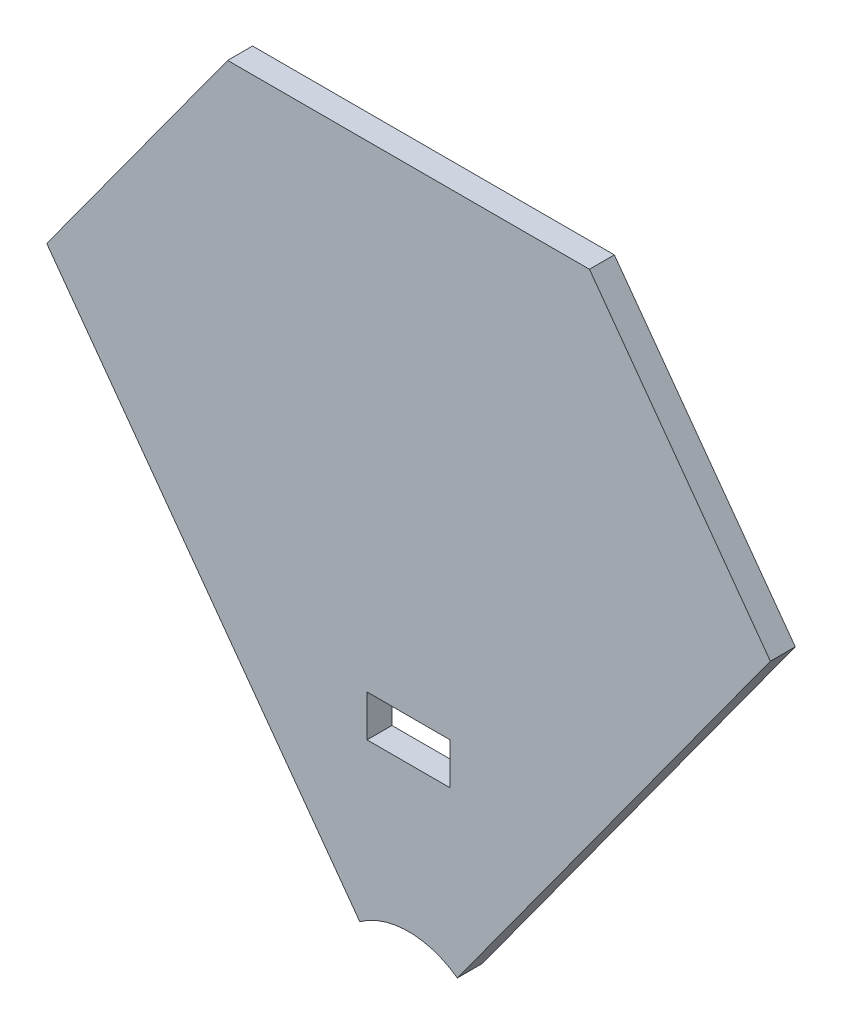
ISO-10303-21;
HEADER;
FILE_DESCRIPTION(('STEP AP214'),'2;1');
FILE_NAME('part.step','',(''),(''),'','','');
FILE_SCHEMA(('AUTOMOTIVE_DESIGN { 1 0 10303 214 1 1 1 1 }'));
ENDSEC;
DATA;
#1=APPLICATION_CONTEXT('core data for automotive mechanical design processes');
#2=APPLICATION_PROTOCOL_DEFINITION('international standard','automotive_design',2000,#1);
#3=PRODUCT_CONTEXT('',#1,'mechanical');
#4=PRODUCT('Part','Part','',(#3));
#5=PRODUCT_RELATED_PRODUCT_CATEGORY('part','',(#4));
#6=PRODUCT_DEFINITION_FORMATION('','',#4);
#7=PRODUCT_DEFINITION_CONTEXT('part definition',#1,'design');
#8=PRODUCT_DEFINITION('design','',#6,#7);
#9=PRODUCT_DEFINITION_SHAPE('','',#8);
#10=(LENGTH_UNIT() NAMED_UNIT(*) SI_UNIT(.MILLI.,.METRE.));
#11=(NAMED_UNIT(*) PLANE_ANGLE_UNIT() SI_UNIT($,.RADIAN.));
#12=(NAMED_UNIT(*) SI_UNIT($,.STERADIAN.) SOLID_ANGLE_UNIT());
#13=UNCERTAINTY_MEASURE_WITH_UNIT(LENGTH_MEASURE(1.E-05),#10,'distance_accuracy_value','');
#14=(GEOMETRIC_REPRESENTATION_CONTEXT(3) GLOBAL_UNCERTAINTY_ASSIGNED_CONTEXT((#13)) GLOBAL_UNIT_ASSIGNED_CONTEXT((#10,
#11,#12)) REPRESENTATION_CONTEXT('',''));
#15=CARTESIAN_POINT('',(0.,0.,0.));
#16=DIRECTION('',(0.,0.,1.));
#17=DIRECTION('',(1.,0.,0.));
#18=AXIS2_PLACEMENT_3D('',#15,#16,#17);
#19=CARTESIAN_POINT('',(0.,0.,3.));
#20=DIRECTION('',(0.,0.,1.));
#21=DIRECTION('',(1.,0.,0.));
#22=AXIS2_PLACEMENT_3D('',#19,#20,#21);
#23=PLANE('',#22);
#24=DIRECTION('',(1.,0.,0.));
#25=VECTOR('',#24,1.);
#26=CARTESIAN_POINT('',(-5.,27.5,3.));
#27=LINE('',#26,#25);
#28=CARTESIAN_POINT('',(-5.,27.5,3.));
#29=VERTEX_POINT('',#28);
#30=CARTESIAN_POINT('',(5.,27.5,3.));
#31=VERTEX_POINT('',#30);
#32=EDGE_CURVE('E166',#29,#31,#27,.T.);
#33=ORIENTED_EDGE('',*,*,#32,.F.);
#34=DIRECTION('',(0.,-1.,0.));
#35=VECTOR('',#34,1.);
#36=CARTESIAN_POINT('',(-5.,32.5,3.));
#37=LINE('',#36,#35);
#38=CARTESIAN_POINT('',(-5.,32.5,3.));
#39=VERTEX_POINT('',#38);
#40=EDGE_CURVE('E152',#39,#29,#37,.T.);
#41=ORIENTED_EDGE('',*,*,#40,.F.);
#42=DIRECTION('',(-1.,0.,0.));
#43=VECTOR('',#42,1.);
#44=CARTESIAN_POINT('',(-5.,32.5,3.));
#45=LINE('',#44,#43);
#46=CARTESIAN_POINT('',(5.,32.5,3.));
#47=VERTEX_POINT('',#46);
#48=EDGE_CURVE('E149',#47,#39,#45,.T.);
#49=ORIENTED_EDGE('',*,*,#48,.F.);
#50=DIRECTION('',(0.,1.,0.));
#51=VECTOR('',#50,1.);
#52=CARTESIAN_POINT('',(5.,32.5,3.));
#53=LINE('',#52,#51);
#54=EDGE_CURVE('E163',#31,#47,#53,.T.);
#55=ORIENTED_EDGE('',*,*,#54,.F.);
#56=EDGE_LOOP('',(#33,#41,#49,#55));
#57=FACE_BOUND('',#56,.T.);
#58=DIRECTION('',(0.587785252292471,-0.809016994374949,0.));
#59=VECTOR('',#58,1.);
#60=CARTESIAN_POINT('',(-54.4906896004018,75.,3.));
#61=LINE('',#60,#59);
#62=CARTESIAN_POINT('',(-43.5925516803214,60.,3.));
#63=VERTEX_POINT('',#62);
#64=CARTESIAN_POINT('',(-5.87785252292472,8.09016994374949,3.));
#65=VERTEX_POINT('',#64);
#66=EDGE_CURVE('E137',#63,#65,#61,.T.);
#67=ORIENTED_EDGE('',*,*,#66,.T.);
#68=CARTESIAN_POINT('',(0.,0.,3.));
#69=DIRECTION('',(0.,0.,-1.));
#70=DIRECTION('',(-1.,0.,0.));
#71=AXIS2_PLACEMENT_3D('',#68,#69,#70);
#72=CIRCLE('',#71,10.);
#73=CARTESIAN_POINT('',(5.87785252292471,8.09016994374949,3.));
#74=VERTEX_POINT('',#73);
#75=EDGE_CURVE('E120',#65,#74,#72,.T.);
#76=ORIENTED_EDGE('',*,*,#75,.T.);
#77=DIRECTION('',(0.587785252292471,0.809016994374949,0.));
#78=VECTOR('',#77,1.);
#79=CARTESIAN_POINT('',(0.,0.,3.));
#80=LINE('',#79,#78);
#81=CARTESIAN_POINT('',(43.5925516803214,60.,3.));
#82=VERTEX_POINT('',#81);
#83=EDGE_CURVE('E50',#74,#82,#80,.T.);
#84=ORIENTED_EDGE('',*,*,#83,.T.);
#85=DIRECTION('',(0.587785252292472,-0.809016994374949,0.));
#86=VECTOR('',#85,1.);
#87=CARTESIAN_POINT('',(21.7962758401607,90.,3.));
#88=LINE('',#87,#86);
#89=CARTESIAN_POINT('',(21.7962758401607,90.,3.));
#90=VERTEX_POINT('',#89);
#91=EDGE_CURVE('E177',#90,#82,#88,.T.);
#92=ORIENTED_EDGE('',*,*,#91,.F.);
#93=DIRECTION('',(1.,0.,0.));
#94=VECTOR('',#93,1.);
#95=CARTESIAN_POINT('',(65.3888275204822,90.,3.));
#96=LINE('',#95,#94);
#97=CARTESIAN_POINT('',(-21.7962758401607,90.,3.));
#98=VERTEX_POINT('',#97);
#99=EDGE_CURVE('E164',#98,#90,#96,.T.);
#100=ORIENTED_EDGE('',*,*,#99,.F.);
#101=DIRECTION('',(0.587785252292472,0.809016994374948,0.));
#102=VECTOR('',#101,1.);
#103=CARTESIAN_POINT('',(-21.7962758401607,90.,3.));
#104=LINE('',#103,#102);
#105=EDGE_CURVE('E182',#63,#98,#104,.T.);
#106=ORIENTED_EDGE('',*,*,#105,.F.);
#107=EDGE_LOOP('',(#67,#76,#84,#92,#100,#106));
#108=FACE_BOUND('',#107,.T.);
#109=ADVANCED_FACE('F39',(#57,#108),#23,.T.);
#110=CARTESIAN_POINT('',(0.,0.,0.));
#111=DIRECTION('',(0.,0.,1.));
#112=DIRECTION('',(1.,0.,0.));
#113=AXIS2_PLACEMENT_3D('',#110,#111,#112);
#114=PLANE('',#113);
#115=DIRECTION('',(0.,-1.,0.));
#116=VECTOR('',#115,1.);
#117=CARTESIAN_POINT('',(-5.,32.5,0.));
#118=LINE('',#117,#116);
#119=CARTESIAN_POINT('',(-5.,32.5,0.));
#120=VERTEX_POINT('',#119);
#121=CARTESIAN_POINT('',(-5.,27.5,0.));
#122=VERTEX_POINT('',#121);
#123=EDGE_CURVE('E158',#120,#122,#118,.T.);
#124=ORIENTED_EDGE('',*,*,#123,.T.);
#125=DIRECTION('',(1.,0.,0.));
#126=VECTOR('',#125,1.);
#127=CARTESIAN_POINT('',(-5.,27.5,0.));
#128=LINE('',#127,#126);
#129=CARTESIAN_POINT('',(5.,27.5,0.));
#130=VERTEX_POINT('',#129);
#131=EDGE_CURVE('E160',#122,#130,#128,.T.);
#132=ORIENTED_EDGE('',*,*,#131,.T.);
#133=DIRECTION('',(0.,1.,0.));
#134=VECTOR('',#133,1.);
#135=CARTESIAN_POINT('',(5.,32.5,0.));
#136=LINE('',#135,#134);
#137=CARTESIAN_POINT('',(5.,32.5,0.));
#138=VERTEX_POINT('',#137);
#139=EDGE_CURVE('E153',#130,#138,#136,.T.);
#140=ORIENTED_EDGE('',*,*,#139,.T.);
#141=DIRECTION('',(-1.,0.,0.));
#142=VECTOR('',#141,1.);
#143=CARTESIAN_POINT('',(-5.,32.5,0.));
#144=LINE('',#143,#142);
#145=EDGE_CURVE('E147',#138,#120,#144,.T.);
#146=ORIENTED_EDGE('',*,*,#145,.T.);
#147=EDGE_LOOP('',(#124,#132,#140,#146));
#148=FACE_BOUND('',#147,.T.);
#149=CARTESIAN_POINT('',(0.,0.,0.));
#150=DIRECTION('',(0.,0.,-1.));
#151=DIRECTION('',(-1.,0.,0.));
#152=AXIS2_PLACEMENT_3D('',#149,#150,#151);
#153=CIRCLE('',#152,10.);
#154=CARTESIAN_POINT('',(-5.87785252292472,8.09016994374949,0.));
#155=VERTEX_POINT('',#154);
#156=CARTESIAN_POINT('',(5.87785252292472,8.09016994374949,0.));
#157=VERTEX_POINT('',#156);
#158=EDGE_CURVE('E53',#155,#157,#153,.T.);
#159=ORIENTED_EDGE('',*,*,#158,.F.);
#160=DIRECTION('',(0.587785252292471,-0.809016994374949,0.));
#161=VECTOR('',#160,1.);
#162=CARTESIAN_POINT('',(-54.4906896004018,75.,0.));
#163=LINE('',#162,#161);
#164=CARTESIAN_POINT('',(-43.5925516803214,60.,0.));
#165=VERTEX_POINT('',#164);
#166=EDGE_CURVE('E128',#165,#155,#163,.T.);
#167=ORIENTED_EDGE('',*,*,#166,.F.);
#168=DIRECTION('',(0.587785252292472,0.809016994374948,0.));
#169=VECTOR('',#168,1.);
#170=CARTESIAN_POINT('',(-21.7962758401607,90.,0.));
#171=LINE('',#170,#169);
#172=CARTESIAN_POINT('',(-21.7962758401607,90.,0.));
#173=VERTEX_POINT('',#172);
#174=EDGE_CURVE('E190',#165,#173,#171,.T.);
#175=ORIENTED_EDGE('',*,*,#174,.T.);
#176=DIRECTION('',(1.,0.,0.));
#177=VECTOR('',#176,1.);
#178=CARTESIAN_POINT('',(65.3888275204822,90.,0.));
#179=LINE('',#178,#177);
#180=CARTESIAN_POINT('',(21.7962758401607,90.,0.));
#181=VERTEX_POINT('',#180);
#182=EDGE_CURVE('E171',#173,#181,#179,.T.);
#183=ORIENTED_EDGE('',*,*,#182,.T.);
#184=DIRECTION('',(0.587785252292472,-0.809016994374949,0.));
#185=VECTOR('',#184,1.);
#186=CARTESIAN_POINT('',(21.7962758401607,90.,0.));
#187=LINE('',#186,#185);
#188=CARTESIAN_POINT('',(43.5925516803214,60.,0.));
#189=VERTEX_POINT('',#188);
#190=EDGE_CURVE('E62',#181,#189,#187,.T.);
#191=ORIENTED_EDGE('',*,*,#190,.T.);
#192=DIRECTION('',(0.587785252292471,0.809016994374949,0.));
#193=VECTOR('',#192,1.);
#194=CARTESIAN_POINT('',(0.,0.,0.));
#195=LINE('',#194,#193);
#196=EDGE_CURVE('E129',#157,#189,#195,.T.);
#197=ORIENTED_EDGE('',*,*,#196,.F.);
#198=EDGE_LOOP('',(#159,#167,#175,#183,#191,#197));
#199=FACE_BOUND('',#198,.T.);
#200=ADVANCED_FACE('F130',(#148,#199),#114,.F.);
#201=CARTESIAN_POINT('',(-54.4906896004018,75.,3.));
#202=DIRECTION('',(0.809016994374949,0.587785252292471,0.));
#203=DIRECTION('',(-0.587785252292471,0.809016994374949,0.));
#204=AXIS2_PLACEMENT_3D('',#201,#202,#203);
#205=PLANE('',#204);
#206=ORIENTED_EDGE('',*,*,#166,.T.);
#207=DIRECTION('',(0.,0.,-1.));
#208=VECTOR('',#207,1.);
#209=CARTESIAN_POINT('',(-5.87785252292472,8.09016994374948,3.));
#210=LINE('',#209,#208);
#211=EDGE_CURVE('E114',#155,#65,#210,.F.);
#212=ORIENTED_EDGE('',*,*,#211,.T.);
#213=ORIENTED_EDGE('',*,*,#66,.F.);
#214=DIRECTION('',(0.,0.,1.));
#215=VECTOR('',#214,1.);
#216=CARTESIAN_POINT('',(-43.5925516803214,60.,0.));
#217=LINE('',#216,#215);
#218=EDGE_CURVE('E134',#165,#63,#217,.T.);
#219=ORIENTED_EDGE('',*,*,#218,.F.);
#220=EDGE_LOOP('',(#206,#212,#213,#219));
#221=FACE_BOUND('',#220,.T.);
#222=ADVANCED_FACE('F41',(#221),#205,.F.);
#223=CARTESIAN_POINT('',(65.3888275204822,90.,134.635082930097));
#224=DIRECTION('',(0.,1.,0.));
#225=DIRECTION('',(0.,0.,1.));
#226=AXIS2_PLACEMENT_3D('',#223,#224,#225);
#227=PLANE('',#226);
#228=ORIENTED_EDGE('',*,*,#182,.F.);
#229=DIRECTION('',(0.,0.,1.));
#230=VECTOR('',#229,1.);
#231=CARTESIAN_POINT('',(-21.7962758401607,90.,0.));
#232=LINE('',#231,#230);
#233=EDGE_CURVE('E176',#173,#98,#232,.T.);
#234=ORIENTED_EDGE('',*,*,#233,.T.);
#235=ORIENTED_EDGE('',*,*,#99,.T.);
#236=DIRECTION('',(0.,0.,1.));
#237=VECTOR('',#236,1.);
#238=CARTESIAN_POINT('',(21.7962758401607,90.,0.));
#239=LINE('',#238,#237);
#240=EDGE_CURVE('E178',#181,#90,#239,.T.);
#241=ORIENTED_EDGE('',*,*,#240,.F.);
#242=EDGE_LOOP('',(#228,#234,#235,#241));
#243=FACE_BOUND('',#242,.T.);
#244=ADVANCED_FACE('F201',(#243),#227,.T.);
#245=CARTESIAN_POINT('',(0.,0.,3.));
#246=DIRECTION('',(-0.809016994374949,0.587785252292471,0.));
#247=DIRECTION('',(-0.587785252292471,-0.809016994374949,0.));
#248=AXIS2_PLACEMENT_3D('',#245,#246,#247);
#249=PLANE('',#248);
#250=ORIENTED_EDGE('',*,*,#83,.F.);
#251=DIRECTION('',(0.,0.,-1.));
#252=VECTOR('',#251,1.);
#253=CARTESIAN_POINT('',(5.87785252292471,8.09016994374949,3.));
#254=LINE('',#253,#252);
#255=EDGE_CURVE('E11',#74,#157,#254,.T.);
#256=ORIENTED_EDGE('',*,*,#255,.T.);
#257=ORIENTED_EDGE('',*,*,#196,.T.);
#258=DIRECTION('',(0.,0.,1.));
#259=VECTOR('',#258,1.);
#260=CARTESIAN_POINT('',(43.5925516803214,60.,0.));
#261=LINE('',#260,#259);
#262=EDGE_CURVE('E125',#189,#82,#261,.T.);
#263=ORIENTED_EDGE('',*,*,#262,.T.);
#264=EDGE_LOOP('',(#250,#256,#257,#263));
#265=FACE_BOUND('',#264,.T.);
#266=ADVANCED_FACE('F200',(#265),#249,.F.);
#267=CARTESIAN_POINT('',(-5.,32.5,3.));
#268=DIRECTION('',(1.,0.,0.));
#269=DIRECTION('',(0.,0.,-1.));
#270=AXIS2_PLACEMENT_3D('',#267,#268,#269);
#271=PLANE('',#270);
#272=ORIENTED_EDGE('',*,*,#123,.F.);
#273=DIRECTION('',(0.,0.,-1.));
#274=VECTOR('',#273,1.);
#275=CARTESIAN_POINT('',(-5.,32.5,3.));
#276=LINE('',#275,#274);
#277=EDGE_CURVE('E148',#39,#120,#276,.T.);
#278=ORIENTED_EDGE('',*,*,#277,.F.);
#279=ORIENTED_EDGE('',*,*,#40,.T.);
#280=DIRECTION('',(0.,0.,-1.));
#281=VECTOR('',#280,1.);
#282=CARTESIAN_POINT('',(-5.,27.5,3.));
#283=LINE('',#282,#281);
#284=EDGE_CURVE('E131',#29,#122,#283,.T.);
#285=ORIENTED_EDGE('',*,*,#284,.T.);
#286=EDGE_LOOP('',(#272,#278,#279,#285));
#287=FACE_BOUND('',#286,.T.);
#288=ADVANCED_FACE('F224',(#287),#271,.T.);
#289=CARTESIAN_POINT('',(-5.,27.5,3.));
#290=DIRECTION('',(0.,1.,0.));
#291=DIRECTION('',(0.,0.,1.));
#292=AXIS2_PLACEMENT_3D('',#289,#290,#291);
#293=PLANE('',#292);
#294=ORIENTED_EDGE('',*,*,#131,.F.);
#295=ORIENTED_EDGE('',*,*,#284,.F.);
#296=ORIENTED_EDGE('',*,*,#32,.T.);
#297=DIRECTION('',(0.,0.,-1.));
#298=VECTOR('',#297,1.);
#299=CARTESIAN_POINT('',(5.,27.5,3.));
#300=LINE('',#299,#298);
#301=EDGE_CURVE('E139',#31,#130,#300,.T.);
#302=ORIENTED_EDGE('',*,*,#301,.T.);
#303=EDGE_LOOP('',(#294,#295,#296,#302));
#304=FACE_BOUND('',#303,.T.);
#305=ADVANCED_FACE('F232',(#304),#293,.T.);
#306=CARTESIAN_POINT('',(5.,32.5,3.));
#307=DIRECTION('',(-1.,0.,0.));
#308=DIRECTION('',(0.,0.,1.));
#309=AXIS2_PLACEMENT_3D('',#306,#307,#308);
#310=PLANE('',#309);
#311=ORIENTED_EDGE('',*,*,#139,.F.);
#312=ORIENTED_EDGE('',*,*,#301,.F.);
#313=ORIENTED_EDGE('',*,*,#54,.T.);
#314=DIRECTION('',(0.,0.,-1.));
#315=VECTOR('',#314,1.);
#316=CARTESIAN_POINT('',(5.,32.5,3.));
#317=LINE('',#316,#315);
#318=EDGE_CURVE('E142',#47,#138,#317,.T.);
#319=ORIENTED_EDGE('',*,*,#318,.T.);
#320=EDGE_LOOP('',(#311,#312,#313,#319));
#321=FACE_BOUND('',#320,.T.);
#322=ADVANCED_FACE('F238',(#321),#310,.T.);
#323=CARTESIAN_POINT('',(-5.,32.5,3.));
#324=DIRECTION('',(0.,-1.,0.));
#325=DIRECTION('',(0.,0.,-1.));
#326=AXIS2_PLACEMENT_3D('',#323,#324,#325);
#327=PLANE('',#326);
#328=ORIENTED_EDGE('',*,*,#145,.F.);
#329=ORIENTED_EDGE('',*,*,#318,.F.);
#330=ORIENTED_EDGE('',*,*,#48,.T.);
#331=ORIENTED_EDGE('',*,*,#277,.T.);
#332=EDGE_LOOP('',(#328,#329,#330,#331));
#333=FACE_BOUND('',#332,.T.);
#334=ADVANCED_FACE('F214',(#333),#327,.T.);
#335=CARTESIAN_POINT('',(21.7962758401607,90.,0.));
#336=DIRECTION('',(-0.809016994374948,-0.587785252292472,0.));
#337=DIRECTION('',(0.587785252292472,-0.809016994374948,0.));
#338=AXIS2_PLACEMENT_3D('',#335,#336,#337);
#339=PLANE('',#338);
#340=ORIENTED_EDGE('',*,*,#91,.T.);
#341=ORIENTED_EDGE('',*,*,#262,.F.);
#342=ORIENTED_EDGE('',*,*,#190,.F.);
#343=ORIENTED_EDGE('',*,*,#240,.T.);
#344=EDGE_LOOP('',(#340,#341,#342,#343));
#345=FACE_BOUND('',#344,.T.);
#346=ADVANCED_FACE('F198',(#345),#339,.F.);
#347=CARTESIAN_POINT('',(-21.7962758401607,90.,0.));
#348=DIRECTION('',(0.809016994374948,-0.587785252292472,0.));
#349=DIRECTION('',(0.587785252292472,0.809016994374949,0.));
#350=AXIS2_PLACEMENT_3D('',#347,#348,#349);
#351=PLANE('',#350);
#352=ORIENTED_EDGE('',*,*,#105,.T.);
#353=ORIENTED_EDGE('',*,*,#233,.F.);
#354=ORIENTED_EDGE('',*,*,#174,.F.);
#355=ORIENTED_EDGE('',*,*,#218,.T.);
#356=EDGE_LOOP('',(#352,#353,#354,#355));
#357=FACE_BOUND('',#356,.T.);
#358=ADVANCED_FACE('F203',(#357),#351,.F.);
#359=CARTESIAN_POINT('',(0.,0.,3.));
#360=DIRECTION('',(0.,0.,-1.));
#361=DIRECTION('',(-1.,0.,0.));
#362=AXIS2_PLACEMENT_3D('',#359,#360,#361);
#363=CYLINDRICAL_SURFACE('',#362,10.);
#364=ORIENTED_EDGE('',*,*,#158,.T.);
#365=ORIENTED_EDGE('',*,*,#255,.F.);
#366=ORIENTED_EDGE('',*,*,#75,.F.);
#367=ORIENTED_EDGE('',*,*,#211,.F.);
#368=EDGE_LOOP('',(#364,#365,#366,#367));
#369=FACE_BOUND('',#368,.T.);
#370=ADVANCED_FACE('F112',(#369),#363,.F.);
#371=CLOSED_SHELL('',(#109,#200,#222,#244,#266,#288,#305,#322,#334,#346,#358,#370));
#372=MANIFOLD_SOLID_BREP('B2',#371);
#373=ADVANCED_BREP_SHAPE_REPRESENTATION('',(#18,#372),#14);
#374=SHAPE_DEFINITION_REPRESENTATION(#9,#373);
ENDSEC;
END-ISO-10303-21;
